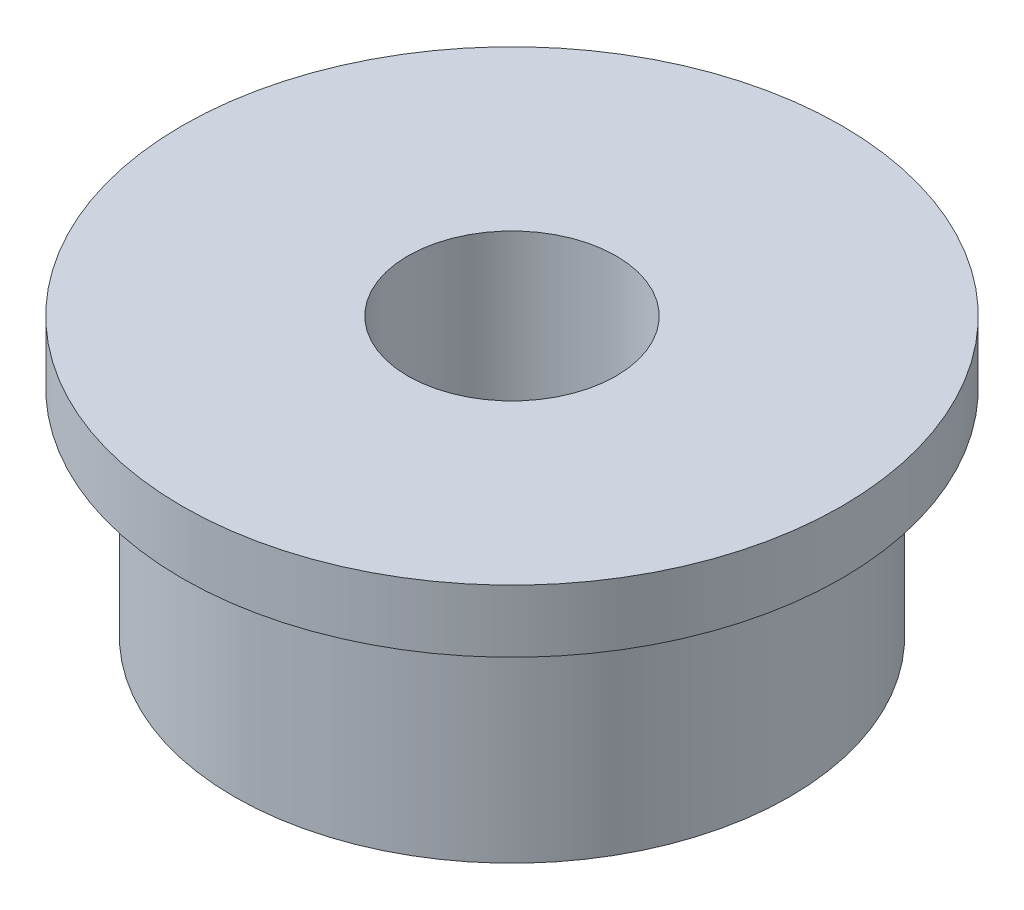
ISO-10303-21;
HEADER;
FILE_DESCRIPTION(('STEP AP214'),'2;1');
FILE_NAME('part.step','',(''),(''),'','','');
FILE_SCHEMA(('AUTOMOTIVE_DESIGN { 1 0 10303 214 1 1 1 1 }'));
ENDSEC;
DATA;
#1=APPLICATION_CONTEXT('core data for automotive mechanical design processes');
#2=APPLICATION_PROTOCOL_DEFINITION('international standard','automotive_design',2000,#1);
#3=PRODUCT_CONTEXT('',#1,'mechanical');
#4=PRODUCT('Part','Part','',(#3));
#5=PRODUCT_RELATED_PRODUCT_CATEGORY('part','',(#4));
#6=PRODUCT_DEFINITION_FORMATION('','',#4);
#7=PRODUCT_DEFINITION_CONTEXT('part definition',#1,'design');
#8=PRODUCT_DEFINITION('design','',#6,#7);
#9=PRODUCT_DEFINITION_SHAPE('','',#8);
#10=(LENGTH_UNIT() NAMED_UNIT(*) SI_UNIT(.MILLI.,.METRE.));
#11=(NAMED_UNIT(*) PLANE_ANGLE_UNIT() SI_UNIT($,.RADIAN.));
#12=(NAMED_UNIT(*) SI_UNIT($,.STERADIAN.) SOLID_ANGLE_UNIT());
#13=UNCERTAINTY_MEASURE_WITH_UNIT(LENGTH_MEASURE(1.E-05),#10,'distance_accuracy_value','');
#14=(GEOMETRIC_REPRESENTATION_CONTEXT(3) GLOBAL_UNCERTAINTY_ASSIGNED_CONTEXT((#13)) GLOBAL_UNIT_ASSIGNED_CONTEXT((#10,
#11,#12)) REPRESENTATION_CONTEXT('',''));
#15=CARTESIAN_POINT('',(0.,0.,0.));
#16=DIRECTION('',(0.,0.,1.));
#17=DIRECTION('',(1.,0.,0.));
#18=AXIS2_PLACEMENT_3D('',#15,#16,#17);
#19=CARTESIAN_POINT('',(0.,0.,0.));
#20=DIRECTION('',(0.,-1.,0.));
#21=DIRECTION('',(0.,0.,-1.));
#22=AXIS2_PLACEMENT_3D('',#19,#20,#21);
#23=CYLINDRICAL_SURFACE('',#22,1.5);
#24=CARTESIAN_POINT('',(0.,0.,0.));
#25=DIRECTION('',(0.,-1.,0.));
#26=DIRECTION('',(0.,0.,-1.));
#27=AXIS2_PLACEMENT_3D('',#24,#25,#26);
#28=CIRCLE('',#27,1.5);
#29=CARTESIAN_POINT('',(0.,0.,-1.5));
#30=VERTEX_POINT('',#29);
#31=EDGE_CURVE('E63',#30,#30,#28,.T.);
#32=ORIENTED_EDGE('',*,*,#31,.T.);
#33=EDGE_LOOP('',(#32));
#34=FACE_BOUND('',#33,.T.);
#35=CARTESIAN_POINT('',(0.,4.,0.));
#36=DIRECTION('',(0.,-1.,0.));
#37=DIRECTION('',(0.,0.,-1.));
#38=AXIS2_PLACEMENT_3D('',#35,#36,#37);
#39=CIRCLE('',#38,1.5);
#40=CARTESIAN_POINT('',(0.,4.,-1.5));
#41=VERTEX_POINT('',#40);
#42=EDGE_CURVE('E10',#41,#41,#39,.T.);
#43=ORIENTED_EDGE('',*,*,#42,.F.);
#44=EDGE_LOOP('',(#43));
#45=FACE_BOUND('',#44,.T.);
#46=ADVANCED_FACE('F41',(#34,#45),#23,.F.);
#47=CARTESIAN_POINT('',(1.5,4.,0.));
#48=DIRECTION('',(0.,1.,0.));
#49=DIRECTION('',(0.,0.,1.));
#50=AXIS2_PLACEMENT_3D('',#47,#48,#49);
#51=PLANE('',#50);
#52=ORIENTED_EDGE('',*,*,#42,.T.);
#53=EDGE_LOOP('',(#52));
#54=FACE_BOUND('',#53,.T.);
#55=CARTESIAN_POINT('',(0.,4.,0.));
#56=DIRECTION('',(0.,-1.,0.));
#57=DIRECTION('',(0.,0.,-1.));
#58=AXIS2_PLACEMENT_3D('',#55,#56,#57);
#59=CIRCLE('',#58,4.75);
#60=CARTESIAN_POINT('',(0.,4.,-4.75));
#61=VERTEX_POINT('',#60);
#62=EDGE_CURVE('E47',#61,#61,#59,.T.);
#63=ORIENTED_EDGE('',*,*,#62,.F.);
#64=EDGE_LOOP('',(#63));
#65=FACE_BOUND('',#64,.T.);
#66=ADVANCED_FACE('F81',(#54,#65),#51,.T.);
#67=CARTESIAN_POINT('',(0.,0.,0.));
#68=DIRECTION('',(0.,-1.,0.));
#69=DIRECTION('',(0.,0.,-1.));
#70=AXIS2_PLACEMENT_3D('',#67,#68,#69);
#71=CYLINDRICAL_SURFACE('',#70,4.75);
#72=ORIENTED_EDGE('',*,*,#62,.T.);
#73=EDGE_LOOP('',(#72));
#74=FACE_BOUND('',#73,.T.);
#75=CARTESIAN_POINT('',(0.,3.1,0.));
#76=DIRECTION('',(0.,-1.,0.));
#77=DIRECTION('',(0.,0.,-1.));
#78=AXIS2_PLACEMENT_3D('',#75,#76,#77);
#79=CIRCLE('',#78,4.75);
#80=CARTESIAN_POINT('',(0.,3.1,-4.75));
#81=VERTEX_POINT('',#80);
#82=EDGE_CURVE('E51',#81,#81,#79,.T.);
#83=ORIENTED_EDGE('',*,*,#82,.F.);
#84=EDGE_LOOP('',(#83));
#85=FACE_BOUND('',#84,.T.);
#86=ADVANCED_FACE('F85',(#74,#85),#71,.T.);
#87=CARTESIAN_POINT('',(4.75,3.1,0.));
#88=DIRECTION('',(0.,-1.,0.));
#89=DIRECTION('',(0.,0.,-1.));
#90=AXIS2_PLACEMENT_3D('',#87,#88,#89);
#91=PLANE('',#90);
#92=ORIENTED_EDGE('',*,*,#82,.T.);
#93=EDGE_LOOP('',(#92));
#94=FACE_BOUND('',#93,.T.);
#95=CARTESIAN_POINT('',(0.,3.1,0.));
#96=DIRECTION('',(0.,-1.,0.));
#97=DIRECTION('',(0.,0.,-1.));
#98=AXIS2_PLACEMENT_3D('',#95,#96,#97);
#99=CIRCLE('',#98,4.);
#100=CARTESIAN_POINT('',(0.,3.1,-4.));
#101=VERTEX_POINT('',#100);
#102=EDGE_CURVE('E55',#101,#101,#99,.T.);
#103=ORIENTED_EDGE('',*,*,#102,.F.);
#104=EDGE_LOOP('',(#103));
#105=FACE_BOUND('',#104,.T.);
#106=ADVANCED_FACE('F77',(#94,#105),#91,.T.);
#107=CARTESIAN_POINT('',(0.,0.,0.));
#108=DIRECTION('',(0.,-1.,0.));
#109=DIRECTION('',(0.,0.,-1.));
#110=AXIS2_PLACEMENT_3D('',#107,#108,#109);
#111=CYLINDRICAL_SURFACE('',#110,4.);
#112=ORIENTED_EDGE('',*,*,#102,.T.);
#113=EDGE_LOOP('',(#112));
#114=FACE_BOUND('',#113,.T.);
#115=CARTESIAN_POINT('',(0.,0.,0.));
#116=DIRECTION('',(0.,-1.,0.));
#117=DIRECTION('',(0.,0.,-1.));
#118=AXIS2_PLACEMENT_3D('',#115,#116,#117);
#119=CIRCLE('',#118,4.);
#120=CARTESIAN_POINT('',(0.,0.,-4.));
#121=VERTEX_POINT('',#120);
#122=EDGE_CURVE('E60',#121,#121,#119,.T.);
#123=ORIENTED_EDGE('',*,*,#122,.F.);
#124=EDGE_LOOP('',(#123));
#125=FACE_BOUND('',#124,.T.);
#126=ADVANCED_FACE('F71',(#114,#125),#111,.T.);
#127=CARTESIAN_POINT('',(4.,0.,0.));
#128=DIRECTION('',(0.,-1.,0.));
#129=DIRECTION('',(0.,0.,-1.));
#130=AXIS2_PLACEMENT_3D('',#127,#128,#129);
#131=PLANE('',#130);
#132=ORIENTED_EDGE('',*,*,#122,.T.);
#133=EDGE_LOOP('',(#132));
#134=FACE_BOUND('',#133,.T.);
#135=ORIENTED_EDGE('',*,*,#31,.F.);
#136=EDGE_LOOP('',(#135));
#137=FACE_BOUND('',#136,.T.);
#138=ADVANCED_FACE('F69',(#134,#137),#131,.T.);
#139=CLOSED_SHELL('',(#46,#66,#86,#106,#126,#138));
#140=MANIFOLD_SOLID_BREP('B2',#139);
#141=ADVANCED_BREP_SHAPE_REPRESENTATION('',(#18,#140),#14);
#142=SHAPE_DEFINITION_REPRESENTATION(#9,#141);
ENDSEC;
END-ISO-10303-21;
